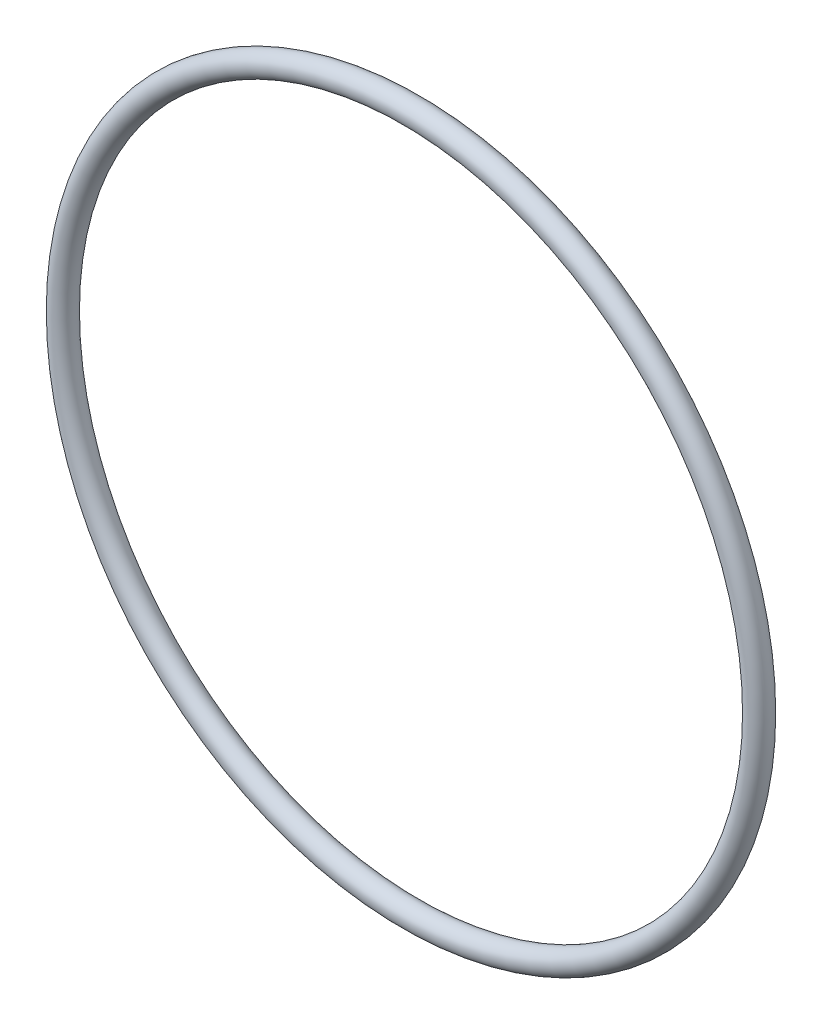
ISO-10303-21;
HEADER;
FILE_DESCRIPTION(('STEP AP214'),'2;1');
FILE_NAME('part.step','',(''),(''),'','','');
FILE_SCHEMA(('AUTOMOTIVE_DESIGN { 1 0 10303 214 1 1 1 1 }'));
ENDSEC;
DATA;
#1=APPLICATION_CONTEXT('core data for automotive mechanical design processes');
#2=APPLICATION_PROTOCOL_DEFINITION('international standard','automotive_design',2000,#1);
#3=PRODUCT_CONTEXT('',#1,'mechanical');
#4=PRODUCT('Part','Part','',(#3));
#5=PRODUCT_RELATED_PRODUCT_CATEGORY('part','',(#4));
#6=PRODUCT_DEFINITION_FORMATION('','',#4);
#7=PRODUCT_DEFINITION_CONTEXT('part definition',#1,'design');
#8=PRODUCT_DEFINITION('design','',#6,#7);
#9=PRODUCT_DEFINITION_SHAPE('','',#8);
#10=(LENGTH_UNIT() NAMED_UNIT(*) SI_UNIT(.MILLI.,.METRE.));
#11=(NAMED_UNIT(*) PLANE_ANGLE_UNIT() SI_UNIT($,.RADIAN.));
#12=(NAMED_UNIT(*) SI_UNIT($,.STERADIAN.) SOLID_ANGLE_UNIT());
#13=UNCERTAINTY_MEASURE_WITH_UNIT(LENGTH_MEASURE(1.E-05),#10,'distance_accuracy_value','');
#14=(GEOMETRIC_REPRESENTATION_CONTEXT(3) GLOBAL_UNCERTAINTY_ASSIGNED_CONTEXT((#13)) GLOBAL_UNIT_ASSIGNED_CONTEXT((#10,
#11,#12)) REPRESENTATION_CONTEXT('',''));
#15=CARTESIAN_POINT('',(0.,0.,0.));
#16=DIRECTION('',(0.,0.,1.));
#17=DIRECTION('',(1.,0.,0.));
#18=AXIS2_PLACEMENT_3D('',#15,#16,#17);
#19=CARTESIAN_POINT('',(0.,0.,0.));
#20=DIRECTION('',(0.,0.,1.));
#21=DIRECTION('',(1.,0.,0.));
#22=AXIS2_PLACEMENT_3D('',#19,#20,#21);
#23=TOROIDAL_SURFACE('',#22,52.3621,1.76530000000001);
#24=CARTESIAN_POINT('',(54.1274,0.,0.));
#25=VERTEX_POINT('',#24);
#26=VERTEX_LOOP('',#25);
#27=FACE_BOUND('',#26,.T.);
#28=ADVANCED_FACE('F28',(#27),#23,.T.);
#29=CLOSED_SHELL('',(#28));
#30=MANIFOLD_SOLID_BREP('B2',#29);
#31=ADVANCED_BREP_SHAPE_REPRESENTATION('',(#18,#30),#14);
#32=SHAPE_DEFINITION_REPRESENTATION(#9,#31);
ENDSEC;
END-ISO-10303-21;
